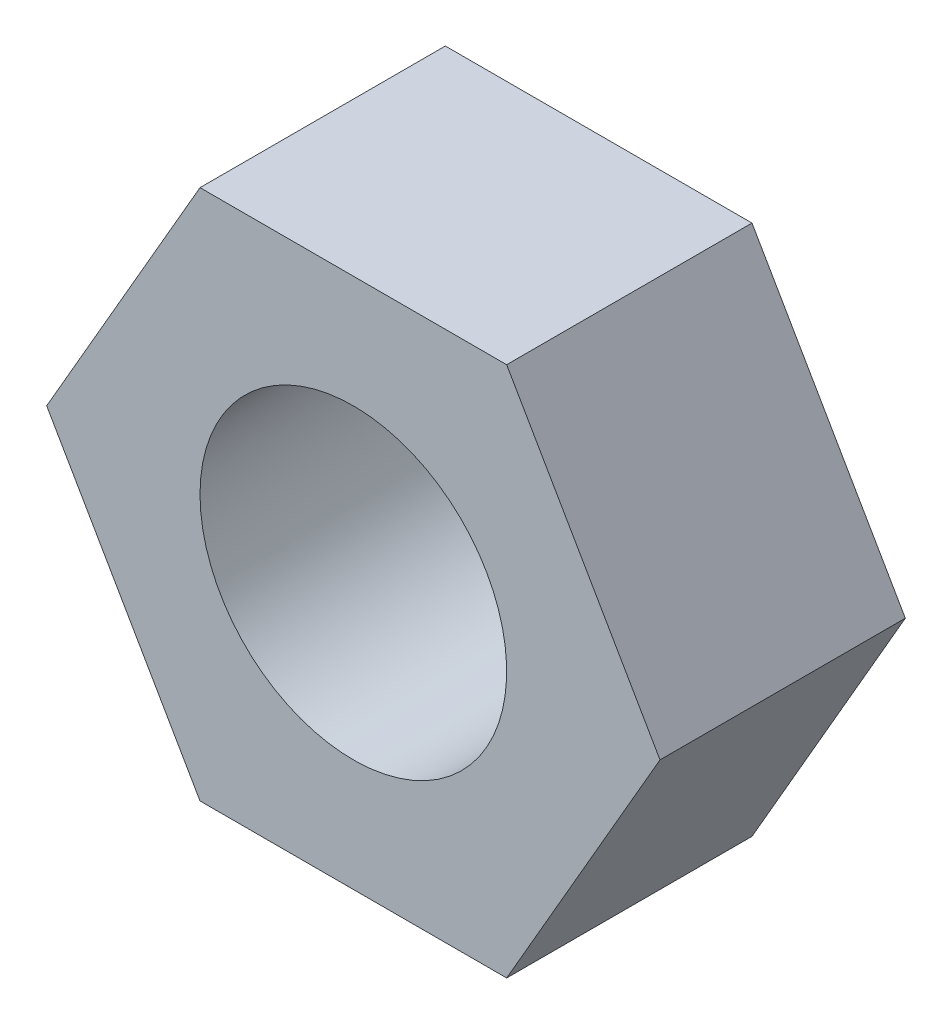
ISO-10303-21;
HEADER;
FILE_DESCRIPTION(('STEP AP214'),'2;1');
FILE_NAME('part.step','',(''),(''),'','','');
FILE_SCHEMA(('AUTOMOTIVE_DESIGN { 1 0 10303 214 1 1 1 1 }'));
ENDSEC;
DATA;
#1=APPLICATION_CONTEXT('core data for automotive mechanical design processes');
#2=APPLICATION_PROTOCOL_DEFINITION('international standard','automotive_design',2000,#1);
#3=PRODUCT_CONTEXT('',#1,'mechanical');
#4=PRODUCT('Part','Part','',(#3));
#5=PRODUCT_RELATED_PRODUCT_CATEGORY('part','',(#4));
#6=PRODUCT_DEFINITION_FORMATION('','',#4);
#7=PRODUCT_DEFINITION_CONTEXT('part definition',#1,'design');
#8=PRODUCT_DEFINITION('design','',#6,#7);
#9=PRODUCT_DEFINITION_SHAPE('','',#8);
#10=(LENGTH_UNIT() NAMED_UNIT(*) SI_UNIT(.MILLI.,.METRE.));
#11=(NAMED_UNIT(*) PLANE_ANGLE_UNIT() SI_UNIT($,.RADIAN.));
#12=(NAMED_UNIT(*) SI_UNIT($,.STERADIAN.) SOLID_ANGLE_UNIT());
#13=UNCERTAINTY_MEASURE_WITH_UNIT(LENGTH_MEASURE(1.E-05),#10,'distance_accuracy_value','');
#14=(GEOMETRIC_REPRESENTATION_CONTEXT(3) GLOBAL_UNCERTAINTY_ASSIGNED_CONTEXT((#13)) GLOBAL_UNIT_ASSIGNED_CONTEXT((#10,
#11,#12)) REPRESENTATION_CONTEXT('',''));
#15=CARTESIAN_POINT('',(0.,0.,0.));
#16=DIRECTION('',(0.,0.,1.));
#17=DIRECTION('',(1.,0.,0.));
#18=AXIS2_PLACEMENT_3D('',#15,#16,#17);
#19=CARTESIAN_POINT('',(2.50000000000005,-4.33012701892216,4.));
#20=DIRECTION('',(-0.866025403784442,0.499999999999995,0.));
#21=DIRECTION('',(-0.499999999999995,-0.866025403784442,0.));
#22=AXIS2_PLACEMENT_3D('',#19,#20,#21);
#23=PLANE('',#22);
#24=DIRECTION('',(0.499999999999995,0.866025403784442,0.));
#25=VECTOR('',#24,1.);
#26=CARTESIAN_POINT('',(2.50000000000005,-4.33012701892216,0.));
#27=LINE('',#26,#25);
#28=CARTESIAN_POINT('',(2.50000000000005,-4.33012701892216,0.));
#29=VERTEX_POINT('',#28);
#30=CARTESIAN_POINT('',(5.,0.,0.));
#31=VERTEX_POINT('',#30);
#32=EDGE_CURVE('E118',#29,#31,#27,.T.);
#33=ORIENTED_EDGE('',*,*,#32,.T.);
#34=DIRECTION('',(0.,0.,-1.));
#35=VECTOR('',#34,1.);
#36=CARTESIAN_POINT('',(5.,0.,4.));
#37=LINE('',#36,#35);
#38=CARTESIAN_POINT('',(5.,0.,4.));
#39=VERTEX_POINT('',#38);
#40=EDGE_CURVE('E11',#39,#31,#37,.T.);
#41=ORIENTED_EDGE('',*,*,#40,.F.);
#42=DIRECTION('',(0.499999999999995,0.866025403784442,0.));
#43=VECTOR('',#42,1.);
#44=CARTESIAN_POINT('',(2.50000000000005,-4.33012701892216,4.));
#45=LINE('',#44,#43);
#46=CARTESIAN_POINT('',(2.50000000000005,-4.33012701892216,4.));
#47=VERTEX_POINT('',#46);
#48=EDGE_CURVE('E129',#47,#39,#45,.T.);
#49=ORIENTED_EDGE('',*,*,#48,.F.);
#50=DIRECTION('',(0.,0.,-1.));
#51=VECTOR('',#50,1.);
#52=CARTESIAN_POINT('',(2.50000000000005,-4.33012701892216,4.));
#53=LINE('',#52,#51);
#54=EDGE_CURVE('E114',#47,#29,#53,.T.);
#55=ORIENTED_EDGE('',*,*,#54,.T.);
#56=EDGE_LOOP('',(#33,#41,#49,#55));
#57=FACE_BOUND('',#56,.T.);
#58=ADVANCED_FACE('F34',(#57),#23,.F.);
#59=CARTESIAN_POINT('',(5.,0.,4.));
#60=DIRECTION('',(-0.866025403784438,-0.500000000000001,0.));
#61=DIRECTION('',(0.500000000000001,-0.866025403784438,0.));
#62=AXIS2_PLACEMENT_3D('',#59,#60,#61);
#63=PLANE('',#62);
#64=DIRECTION('',(-0.500000000000001,0.866025403784438,0.));
#65=VECTOR('',#64,1.);
#66=CARTESIAN_POINT('',(5.,0.,0.));
#67=LINE('',#66,#65);
#68=CARTESIAN_POINT('',(2.49999999999999,4.3301270189222,0.));
#69=VERTEX_POINT('',#68);
#70=EDGE_CURVE('E121',#31,#69,#67,.T.);
#71=ORIENTED_EDGE('',*,*,#70,.T.);
#72=DIRECTION('',(0.,0.,-1.));
#73=VECTOR('',#72,1.);
#74=CARTESIAN_POINT('',(2.49999999999999,4.3301270189222,4.));
#75=LINE('',#74,#73);
#76=CARTESIAN_POINT('',(2.49999999999999,4.3301270189222,4.));
#77=VERTEX_POINT('',#76);
#78=EDGE_CURVE('E42',#77,#69,#75,.T.);
#79=ORIENTED_EDGE('',*,*,#78,.F.);
#80=DIRECTION('',(-0.500000000000001,0.866025403784438,0.));
#81=VECTOR('',#80,1.);
#82=CARTESIAN_POINT('',(5.,0.,4.));
#83=LINE('',#82,#81);
#84=EDGE_CURVE('E87',#39,#77,#83,.T.);
#85=ORIENTED_EDGE('',*,*,#84,.F.);
#86=ORIENTED_EDGE('',*,*,#40,.T.);
#87=EDGE_LOOP('',(#71,#79,#85,#86));
#88=FACE_BOUND('',#87,.T.);
#89=ADVANCED_FACE('F154',(#88),#63,.F.);
#90=CARTESIAN_POINT('',(2.49999999999999,4.3301270189222,4.));
#91=DIRECTION('',(0.,-1.,0.));
#92=DIRECTION('',(1.,0.,0.));
#93=AXIS2_PLACEMENT_3D('',#90,#91,#92);
#94=PLANE('',#93);
#95=DIRECTION('',(-1.,0.,0.));
#96=VECTOR('',#95,1.);
#97=CARTESIAN_POINT('',(2.49999999999999,4.3301270189222,0.));
#98=LINE('',#97,#96);
#99=CARTESIAN_POINT('',(-2.50000000000002,4.33012701892218,0.));
#100=VERTEX_POINT('',#99);
#101=EDGE_CURVE('E124',#69,#100,#98,.T.);
#102=ORIENTED_EDGE('',*,*,#101,.T.);
#103=DIRECTION('',(0.,0.,-1.));
#104=VECTOR('',#103,1.);
#105=CARTESIAN_POINT('',(-2.50000000000002,4.33012701892218,4.));
#106=LINE('',#105,#104);
#107=CARTESIAN_POINT('',(-2.50000000000002,4.33012701892218,4.));
#108=VERTEX_POINT('',#107);
#109=EDGE_CURVE('E109',#108,#100,#106,.T.);
#110=ORIENTED_EDGE('',*,*,#109,.F.);
#111=DIRECTION('',(-1.,0.,0.));
#112=VECTOR('',#111,1.);
#113=CARTESIAN_POINT('',(2.49999999999999,4.3301270189222,4.));
#114=LINE('',#113,#112);
#115=EDGE_CURVE('E100',#77,#108,#114,.T.);
#116=ORIENTED_EDGE('',*,*,#115,.F.);
#117=ORIENTED_EDGE('',*,*,#78,.T.);
#118=EDGE_LOOP('',(#102,#110,#116,#117));
#119=FACE_BOUND('',#118,.T.);
#120=ADVANCED_FACE('F135',(#119),#94,.F.);
#121=CARTESIAN_POINT('',(-2.50000000000002,4.33012701892218,4.));
#122=DIRECTION('',(0.866025403784442,-0.499999999999995,0.));
#123=DIRECTION('',(0.499999999999995,0.866025403784442,0.));
#124=AXIS2_PLACEMENT_3D('',#121,#122,#123);
#125=PLANE('',#124);
#126=DIRECTION('',(-0.499999999999995,-0.866025403784442,0.));
#127=VECTOR('',#126,1.);
#128=CARTESIAN_POINT('',(-2.50000000000002,4.33012701892218,0.));
#129=LINE('',#128,#127);
#130=CARTESIAN_POINT('',(-5.,0.,0.));
#131=VERTEX_POINT('',#130);
#132=EDGE_CURVE('E108',#100,#131,#129,.T.);
#133=ORIENTED_EDGE('',*,*,#132,.T.);
#134=DIRECTION('',(0.,0.,-1.));
#135=VECTOR('',#134,1.);
#136=CARTESIAN_POINT('',(-5.,0.,4.));
#137=LINE('',#136,#135);
#138=CARTESIAN_POINT('',(-5.,0.,4.));
#139=VERTEX_POINT('',#138);
#140=EDGE_CURVE('E105',#139,#131,#137,.T.);
#141=ORIENTED_EDGE('',*,*,#140,.F.);
#142=DIRECTION('',(-0.499999999999995,-0.866025403784442,0.));
#143=VECTOR('',#142,1.);
#144=CARTESIAN_POINT('',(-2.50000000000002,4.33012701892218,4.));
#145=LINE('',#144,#143);
#146=EDGE_CURVE('E94',#108,#139,#145,.T.);
#147=ORIENTED_EDGE('',*,*,#146,.F.);
#148=ORIENTED_EDGE('',*,*,#109,.T.);
#149=EDGE_LOOP('',(#133,#141,#147,#148));
#150=FACE_BOUND('',#149,.T.);
#151=ADVANCED_FACE('F106',(#150),#125,.F.);
#152=CARTESIAN_POINT('',(-5.,0.,4.));
#153=DIRECTION('',(0.866025403784435,0.500000000000007,0.));
#154=DIRECTION('',(-0.500000000000007,0.866025403784435,0.));
#155=AXIS2_PLACEMENT_3D('',#152,#153,#154);
#156=PLANE('',#155);
#157=DIRECTION('',(0.500000000000007,-0.866025403784435,0.));
#158=VECTOR('',#157,1.);
#159=CARTESIAN_POINT('',(-5.,0.,0.));
#160=LINE('',#159,#158);
#161=CARTESIAN_POINT('',(-2.49999999999996,-4.33012701892222,0.));
#162=VERTEX_POINT('',#161);
#163=EDGE_CURVE('E73',#131,#162,#160,.T.);
#164=ORIENTED_EDGE('',*,*,#163,.T.);
#165=DIRECTION('',(0.,0.,-1.));
#166=VECTOR('',#165,1.);
#167=CARTESIAN_POINT('',(-2.49999999999996,-4.33012701892222,4.));
#168=LINE('',#167,#166);
#169=CARTESIAN_POINT('',(-2.49999999999996,-4.33012701892222,4.));
#170=VERTEX_POINT('',#169);
#171=EDGE_CURVE('E110',#170,#162,#168,.T.);
#172=ORIENTED_EDGE('',*,*,#171,.F.);
#173=DIRECTION('',(0.500000000000007,-0.866025403784435,0.));
#174=VECTOR('',#173,1.);
#175=CARTESIAN_POINT('',(-5.,0.,4.));
#176=LINE('',#175,#174);
#177=EDGE_CURVE('E98',#139,#170,#176,.T.);
#178=ORIENTED_EDGE('',*,*,#177,.F.);
#179=ORIENTED_EDGE('',*,*,#140,.T.);
#180=EDGE_LOOP('',(#164,#172,#178,#179));
#181=FACE_BOUND('',#180,.T.);
#182=ADVANCED_FACE('F112',(#181),#156,.F.);
#183=CARTESIAN_POINT('',(-2.49999999999996,-4.33012701892222,4.));
#184=DIRECTION('',(0.,1.,0.));
#185=DIRECTION('',(-1.,0.,0.));
#186=AXIS2_PLACEMENT_3D('',#183,#184,#185);
#187=PLANE('',#186);
#188=DIRECTION('',(1.,0.,0.));
#189=VECTOR('',#188,1.);
#190=CARTESIAN_POINT('',(-2.49999999999996,-4.33012701892222,0.));
#191=LINE('',#190,#189);
#192=EDGE_CURVE('E79',#162,#29,#191,.T.);
#193=ORIENTED_EDGE('',*,*,#192,.T.);
#194=ORIENTED_EDGE('',*,*,#54,.F.);
#195=DIRECTION('',(1.,0.,0.));
#196=VECTOR('',#195,1.);
#197=CARTESIAN_POINT('',(-2.49999999999996,-4.33012701892222,4.));
#198=LINE('',#197,#196);
#199=EDGE_CURVE('E50',#170,#47,#198,.T.);
#200=ORIENTED_EDGE('',*,*,#199,.F.);
#201=ORIENTED_EDGE('',*,*,#171,.T.);
#202=EDGE_LOOP('',(#193,#194,#200,#201));
#203=FACE_BOUND('',#202,.T.);
#204=ADVANCED_FACE('F142',(#203),#187,.F.);
#205=CARTESIAN_POINT('',(0.,0.,4.));
#206=DIRECTION('',(0.,0.,1.));
#207=DIRECTION('',(1.,0.,0.));
#208=AXIS2_PLACEMENT_3D('',#205,#206,#207);
#209=PLANE('',#208);
#210=CARTESIAN_POINT('',(0.,0.,4.));
#211=DIRECTION('',(0.,0.,-1.));
#212=DIRECTION('',(-1.,0.,0.));
#213=AXIS2_PLACEMENT_3D('',#210,#211,#212);
#214=CIRCLE('',#213,2.5);
#215=CARTESIAN_POINT('',(-2.5,0.,4.));
#216=VERTEX_POINT('',#215);
#217=EDGE_CURVE('E122',#216,#216,#214,.T.);
#218=ORIENTED_EDGE('',*,*,#217,.T.);
#219=EDGE_LOOP('',(#218));
#220=FACE_BOUND('',#219,.T.);
#221=ORIENTED_EDGE('',*,*,#48,.T.);
#222=ORIENTED_EDGE('',*,*,#84,.T.);
#223=ORIENTED_EDGE('',*,*,#115,.T.);
#224=ORIENTED_EDGE('',*,*,#146,.T.);
#225=ORIENTED_EDGE('',*,*,#177,.T.);
#226=ORIENTED_EDGE('',*,*,#199,.T.);
#227=EDGE_LOOP('',(#221,#222,#223,#224,#225,#226));
#228=FACE_BOUND('',#227,.T.);
#229=ADVANCED_FACE('F96',(#220,#228),#209,.T.);
#230=CARTESIAN_POINT('',(0.,0.,0.));
#231=DIRECTION('',(0.,0.,1.));
#232=DIRECTION('',(1.,0.,0.));
#233=AXIS2_PLACEMENT_3D('',#230,#231,#232);
#234=PLANE('',#233);
#235=CARTESIAN_POINT('',(0.,0.,0.));
#236=DIRECTION('',(0.,0.,-1.));
#237=DIRECTION('',(-1.,0.,0.));
#238=AXIS2_PLACEMENT_3D('',#235,#236,#237);
#239=CIRCLE('',#238,2.5);
#240=CARTESIAN_POINT('',(-2.5,0.,0.));
#241=VERTEX_POINT('',#240);
#242=EDGE_CURVE('E209',#241,#241,#239,.T.);
#243=ORIENTED_EDGE('',*,*,#242,.F.);
#244=EDGE_LOOP('',(#243));
#245=FACE_BOUND('',#244,.T.);
#246=ORIENTED_EDGE('',*,*,#32,.F.);
#247=ORIENTED_EDGE('',*,*,#192,.F.);
#248=ORIENTED_EDGE('',*,*,#163,.F.);
#249=ORIENTED_EDGE('',*,*,#132,.F.);
#250=ORIENTED_EDGE('',*,*,#101,.F.);
#251=ORIENTED_EDGE('',*,*,#70,.F.);
#252=EDGE_LOOP('',(#246,#247,#248,#249,#250,#251));
#253=FACE_BOUND('',#252,.T.);
#254=ADVANCED_FACE('F138',(#245,#253),#234,.F.);
#255=CARTESIAN_POINT('',(0.,0.,4.));
#256=DIRECTION('',(0.,0.,-1.));
#257=DIRECTION('',(-1.,0.,0.));
#258=AXIS2_PLACEMENT_3D('',#255,#256,#257);
#259=CYLINDRICAL_SURFACE('',#258,2.5);
#260=ORIENTED_EDGE('',*,*,#217,.F.);
#261=EDGE_LOOP('',(#260));
#262=FACE_BOUND('',#261,.T.);
#263=ORIENTED_EDGE('',*,*,#242,.T.);
#264=EDGE_LOOP('',(#263));
#265=FACE_BOUND('',#264,.T.);
#266=ADVANCED_FACE('F191',(#262,#265),#259,.F.);
#267=CLOSED_SHELL('',(#58,#89,#120,#151,#182,#204,#229,#254,#266));
#268=MANIFOLD_SOLID_BREP('B2',#267);
#269=ADVANCED_BREP_SHAPE_REPRESENTATION('',(#18,#268),#14);
#270=SHAPE_DEFINITION_REPRESENTATION(#9,#269);
ENDSEC;
END-ISO-10303-21;
